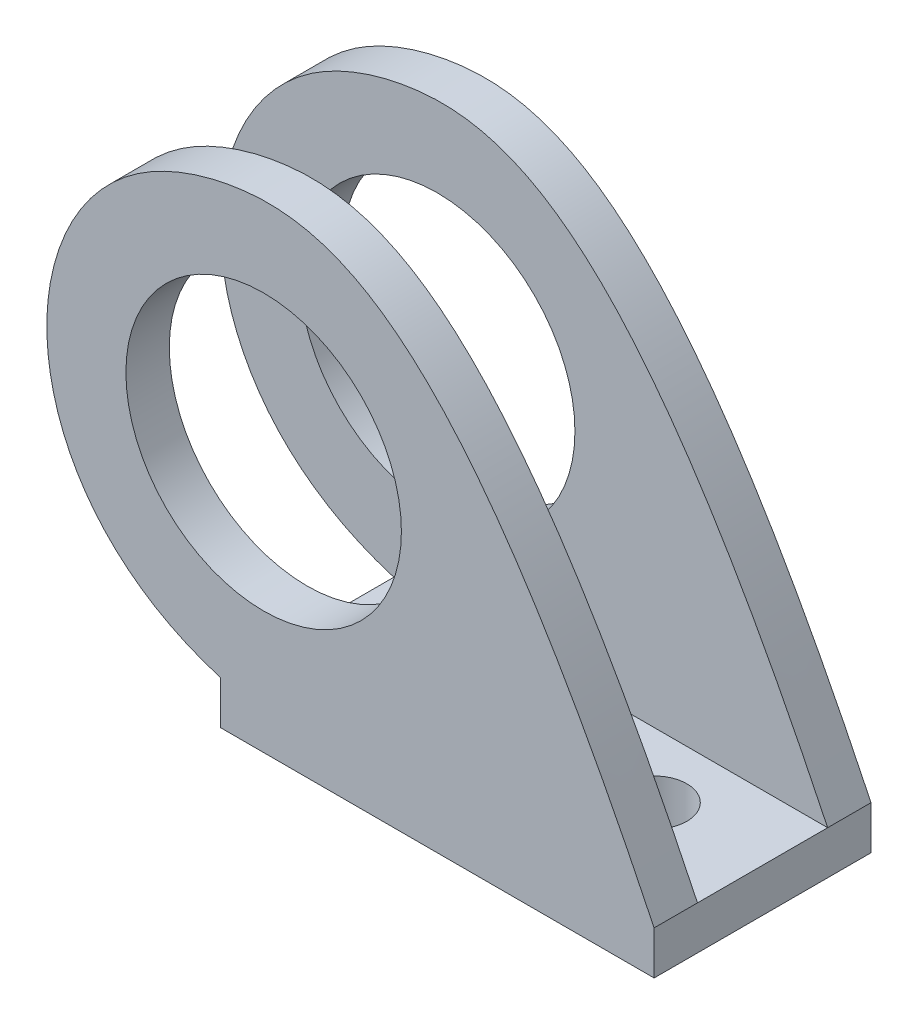
ISO-10303-21;
HEADER;
FILE_DESCRIPTION(('STEP AP214'),'2;1');
FILE_NAME('part.step','',(''),(''),'','','');
FILE_SCHEMA(('AUTOMOTIVE_DESIGN { 1 0 10303 214 1 1 1 1 }'));
ENDSEC;
DATA;
#1=APPLICATION_CONTEXT('core data for automotive mechanical design processes');
#2=APPLICATION_PROTOCOL_DEFINITION('international standard','automotive_design',2000,#1);
#3=PRODUCT_CONTEXT('',#1,'mechanical');
#4=PRODUCT('Part','Part','',(#3));
#5=PRODUCT_RELATED_PRODUCT_CATEGORY('part','',(#4));
#6=PRODUCT_DEFINITION_FORMATION('','',#4);
#7=PRODUCT_DEFINITION_CONTEXT('part definition',#1,'design');
#8=PRODUCT_DEFINITION('design','',#6,#7);
#9=PRODUCT_DEFINITION_SHAPE('','',#8);
#10=(LENGTH_UNIT() NAMED_UNIT(*) SI_UNIT(.MILLI.,.METRE.));
#11=(NAMED_UNIT(*) PLANE_ANGLE_UNIT() SI_UNIT($,.RADIAN.));
#12=(NAMED_UNIT(*) SI_UNIT($,.STERADIAN.) SOLID_ANGLE_UNIT());
#13=UNCERTAINTY_MEASURE_WITH_UNIT(LENGTH_MEASURE(1.E-05),#10,'distance_accuracy_value','');
#14=(GEOMETRIC_REPRESENTATION_CONTEXT(3) GLOBAL_UNCERTAINTY_ASSIGNED_CONTEXT((#13)) GLOBAL_UNIT_ASSIGNED_CONTEXT((#10,
#11,#12)) REPRESENTATION_CONTEXT('',''));
#15=CARTESIAN_POINT('',(0.,0.,0.));
#16=DIRECTION('',(0.,0.,1.));
#17=DIRECTION('',(1.,0.,0.));
#18=AXIS2_PLACEMENT_3D('',#15,#16,#17);
#19=CARTESIAN_POINT('',(0.,2.,0.));
#20=DIRECTION('',(0.,-1.,0.));
#21=DIRECTION('',(0.,0.,-1.));
#22=AXIS2_PLACEMENT_3D('',#19,#20,#21);
#23=PLANE('',#22);
#24=CARTESIAN_POINT('',(5.,2.,-0.0100000000000002));
#25=DIRECTION('',(0.,1.,0.));
#26=DIRECTION('',(0.,0.,1.));
#27=AXIS2_PLACEMENT_3D('',#24,#25,#26);
#28=CIRCLE('',#27,1.5);
#29=CARTESIAN_POINT('',(5.,2.,1.49));
#30=VERTEX_POINT('',#29);
#31=EDGE_CURVE('E167',#30,#30,#28,.T.);
#32=ORIENTED_EDGE('',*,*,#31,.F.);
#33=EDGE_LOOP('',(#32));
#34=FACE_BOUND('',#33,.T.);
#35=CARTESIAN_POINT('',(-5.,2.,-0.00999999999999959));
#36=DIRECTION('',(0.,1.,0.));
#37=DIRECTION('',(0.,0.,1.));
#38=AXIS2_PLACEMENT_3D('',#35,#36,#37);
#39=CIRCLE('',#38,1.5);
#40=CARTESIAN_POINT('',(-5.,2.,1.49));
#41=VERTEX_POINT('',#40);
#42=EDGE_CURVE('E121',#41,#41,#39,.T.);
#43=ORIENTED_EDGE('',*,*,#42,.F.);
#44=EDGE_LOOP('',(#43));
#45=FACE_BOUND('',#44,.T.);
#46=DIRECTION('',(0.,0.,-1.));
#47=VECTOR('',#46,1.);
#48=CARTESIAN_POINT('',(10.,2.,5.));
#49=LINE('',#48,#47);
#50=CARTESIAN_POINT('',(10.,2.,3.));
#51=VERTEX_POINT('',#50);
#52=CARTESIAN_POINT('',(10.,2.,-3.));
#53=VERTEX_POINT('',#52);
#54=EDGE_CURVE('E99',#51,#53,#49,.T.);
#55=ORIENTED_EDGE('',*,*,#54,.T.);
#56=DIRECTION('',(-1.,0.,0.));
#57=VECTOR('',#56,1.);
#58=CARTESIAN_POINT('',(0.,2.,-3.));
#59=LINE('',#58,#57);
#60=CARTESIAN_POINT('',(-10.,2.,-3.));
#61=VERTEX_POINT('',#60);
#62=EDGE_CURVE('E97',#53,#61,#59,.T.);
#63=ORIENTED_EDGE('',*,*,#62,.T.);
#64=DIRECTION('',(0.,0.,1.));
#65=VECTOR('',#64,1.);
#66=CARTESIAN_POINT('',(-10.,2.,5.));
#67=LINE('',#66,#65);
#68=CARTESIAN_POINT('',(-10.,2.,3.));
#69=VERTEX_POINT('',#68);
#70=EDGE_CURVE('E85',#61,#69,#67,.T.);
#71=ORIENTED_EDGE('',*,*,#70,.T.);
#72=DIRECTION('',(-1.,0.,0.));
#73=VECTOR('',#72,1.);
#74=CARTESIAN_POINT('',(0.,2.,3.));
#75=LINE('',#74,#73);
#76=EDGE_CURVE('E54',#51,#69,#75,.T.);
#77=ORIENTED_EDGE('',*,*,#76,.F.);
#78=EDGE_LOOP('',(#55,#63,#71,#77));
#79=FACE_BOUND('',#78,.T.);
#80=ADVANCED_FACE('F32',(#34,#45,#79),#23,.F.);
#81=CARTESIAN_POINT('',(0.,0.,0.));
#82=DIRECTION('',(0.,-1.,0.));
#83=DIRECTION('',(0.,0.,-1.));
#84=AXIS2_PLACEMENT_3D('',#81,#82,#83);
#85=PLANE('',#84);
#86=DIRECTION('',(1.,0.,0.));
#87=VECTOR('',#86,1.);
#88=CARTESIAN_POINT('',(-10.,0.,5.));
#89=LINE('',#88,#87);
#90=CARTESIAN_POINT('',(-10.,0.,5.));
#91=VERTEX_POINT('',#90);
#92=CARTESIAN_POINT('',(10.,0.,5.));
#93=VERTEX_POINT('',#92);
#94=EDGE_CURVE('E125',#91,#93,#89,.T.);
#95=ORIENTED_EDGE('',*,*,#94,.F.);
#96=DIRECTION('',(0.,0.,1.));
#97=VECTOR('',#96,1.);
#98=CARTESIAN_POINT('',(-10.,0.,5.));
#99=LINE('',#98,#97);
#100=CARTESIAN_POINT('',(-10.,0.,-5.));
#101=VERTEX_POINT('',#100);
#102=EDGE_CURVE('E123',#101,#91,#99,.T.);
#103=ORIENTED_EDGE('',*,*,#102,.F.);
#104=DIRECTION('',(-1.,0.,0.));
#105=VECTOR('',#104,1.);
#106=CARTESIAN_POINT('',(-10.,0.,-5.));
#107=LINE('',#106,#105);
#108=CARTESIAN_POINT('',(10.,0.,-5.));
#109=VERTEX_POINT('',#108);
#110=EDGE_CURVE('E120',#109,#101,#107,.T.);
#111=ORIENTED_EDGE('',*,*,#110,.F.);
#112=DIRECTION('',(0.,0.,-1.));
#113=VECTOR('',#112,1.);
#114=CARTESIAN_POINT('',(10.,0.,5.));
#115=LINE('',#114,#113);
#116=EDGE_CURVE('E118',#93,#109,#115,.T.);
#117=ORIENTED_EDGE('',*,*,#116,.F.);
#118=EDGE_LOOP('',(#95,#103,#111,#117));
#119=FACE_BOUND('',#118,.T.);
#120=CARTESIAN_POINT('',(-5.,0.,-0.00999999999999959));
#121=DIRECTION('',(0.,1.,0.));
#122=DIRECTION('',(0.,0.,1.));
#123=AXIS2_PLACEMENT_3D('',#120,#121,#122);
#124=CIRCLE('',#123,1.5);
#125=CARTESIAN_POINT('',(-5.,0.,1.49));
#126=VERTEX_POINT('',#125);
#127=EDGE_CURVE('E170',#126,#126,#124,.T.);
#128=ORIENTED_EDGE('',*,*,#127,.T.);
#129=EDGE_LOOP('',(#128));
#130=FACE_BOUND('',#129,.T.);
#131=CARTESIAN_POINT('',(5.,0.,-0.0100000000000002));
#132=DIRECTION('',(0.,1.,0.));
#133=DIRECTION('',(0.,0.,1.));
#134=AXIS2_PLACEMENT_3D('',#131,#132,#133);
#135=CIRCLE('',#134,1.5);
#136=CARTESIAN_POINT('',(5.,0.,1.49));
#137=VERTEX_POINT('',#136);
#138=EDGE_CURVE('E166',#137,#137,#135,.T.);
#139=ORIENTED_EDGE('',*,*,#138,.T.);
#140=EDGE_LOOP('',(#139));
#141=FACE_BOUND('',#140,.T.);
#142=ADVANCED_FACE('F133',(#119,#130,#141),#85,.T.);
#143=CARTESIAN_POINT('',(10.,2.,5.));
#144=DIRECTION('',(-1.,0.,0.));
#145=DIRECTION('',(0.,0.,1.));
#146=AXIS2_PLACEMENT_3D('',#143,#144,#145);
#147=PLANE('',#146);
#148=ORIENTED_EDGE('',*,*,#116,.T.);
#149=DIRECTION('',(0.,-1.,0.));
#150=VECTOR('',#149,1.);
#151=CARTESIAN_POINT('',(10.,2.,-5.));
#152=LINE('',#151,#150);
#153=CARTESIAN_POINT('',(10.,2.,-5.));
#154=VERTEX_POINT('',#153);
#155=EDGE_CURVE('E11',#154,#109,#152,.T.);
#156=ORIENTED_EDGE('',*,*,#155,.F.);
#157=DIRECTION('',(0.,0.,-1.));
#158=VECTOR('',#157,1.);
#159=CARTESIAN_POINT('',(10.,2.,-3.));
#160=LINE('',#159,#158);
#161=EDGE_CURVE('E47',#53,#154,#160,.T.);
#162=ORIENTED_EDGE('',*,*,#161,.F.);
#163=ORIENTED_EDGE('',*,*,#54,.F.);
#164=CARTESIAN_POINT('',(10.,2.,5.));
#165=VERTEX_POINT('',#164);
#166=EDGE_CURVE('E94',#165,#51,#49,.T.);
#167=ORIENTED_EDGE('',*,*,#166,.F.);
#168=DIRECTION('',(0.,-1.,0.));
#169=VECTOR('',#168,1.);
#170=CARTESIAN_POINT('',(10.,2.,5.));
#171=LINE('',#170,#169);
#172=EDGE_CURVE('E111',#165,#93,#171,.T.);
#173=ORIENTED_EDGE('',*,*,#172,.T.);
#174=EDGE_LOOP('',(#148,#156,#162,#163,#167,#173));
#175=FACE_BOUND('',#174,.T.);
#176=ADVANCED_FACE('F34',(#175),#147,.F.);
#177=CARTESIAN_POINT('',(-10.,2.,-5.));
#178=DIRECTION('',(0.,0.,1.));
#179=DIRECTION('',(1.,0.,0.));
#180=AXIS2_PLACEMENT_3D('',#177,#178,#179);
#181=PLANE('',#180);
#182=ORIENTED_EDGE('',*,*,#110,.T.);
#183=DIRECTION('',(0.,-1.,0.));
#184=VECTOR('',#183,1.);
#185=CARTESIAN_POINT('',(-10.,2.,-5.));
#186=LINE('',#185,#184);
#187=CARTESIAN_POINT('',(-10.,2.,-5.));
#188=VERTEX_POINT('',#187);
#189=EDGE_CURVE('E40',#188,#101,#186,.T.);
#190=ORIENTED_EDGE('',*,*,#189,.F.);
#191=CARTESIAN_POINT('',(10.,1.99999999999994,-5.));
#192=CARTESIAN_POINT('',(1.47048046340723,19.8137886636705,-5.));
#193=CARTESIAN_POINT('',(-5.49688785335975,23.5991499023757,-5.));
#194=CARTESIAN_POINT('',(-20.0011230045606,18.401993577392,-5.));
#195=CARTESIAN_POINT('',(-19.9343125674714,5.00893865284892,-5.));
#196=CARTESIAN_POINT('',(-10.,2.,-5.));
#197=B_SPLINE_CURVE_WITH_KNOTS('',3,(#191,#192,#193,#194,#195,#196),.UNSPECIFIED.,.F.,.F.,(4,1,
1,4),(0.,0.373203038213867,0.473203038213867,1.),.UNSPECIFIED.);
#198=EDGE_CURVE('E107',#154,#188,#197,.T.);
#199=ORIENTED_EDGE('',*,*,#198,.F.);
#200=ORIENTED_EDGE('',*,*,#155,.T.);
#201=EDGE_LOOP('',(#182,#190,#199,#200));
#202=FACE_BOUND('',#201,.T.);
#203=CARTESIAN_POINT('',(-8.,12.,-5.));
#204=DIRECTION('',(0.,0.,1.));
#205=DIRECTION('',(1.,0.,0.));
#206=AXIS2_PLACEMENT_3D('',#203,#204,#205);
#207=CIRCLE('',#206,6.35);
#208=CARTESIAN_POINT('',(-1.65,12.,-5.));
#209=VERTEX_POINT('',#208);
#210=EDGE_CURVE('E210',#209,#209,#207,.T.);
#211=ORIENTED_EDGE('',*,*,#210,.T.);
#212=EDGE_LOOP('',(#211));
#213=FACE_BOUND('',#212,.T.);
#214=ADVANCED_FACE('F202',(#202,#213),#181,.F.);
#215=CARTESIAN_POINT('',(-10.,2.,5.));
#216=DIRECTION('',(1.,0.,0.));
#217=DIRECTION('',(0.,0.,-1.));
#218=AXIS2_PLACEMENT_3D('',#215,#216,#217);
#219=PLANE('',#218);
#220=ORIENTED_EDGE('',*,*,#70,.F.);
#221=EDGE_CURVE('E90',#188,#61,#67,.T.);
#222=ORIENTED_EDGE('',*,*,#221,.F.);
#223=ORIENTED_EDGE('',*,*,#189,.T.);
#224=ORIENTED_EDGE('',*,*,#102,.T.);
#225=DIRECTION('',(0.,-1.,0.));
#226=VECTOR('',#225,1.);
#227=CARTESIAN_POINT('',(-10.,2.,5.));
#228=LINE('',#227,#226);
#229=CARTESIAN_POINT('',(-10.,2.,5.));
#230=VERTEX_POINT('',#229);
#231=EDGE_CURVE('E113',#230,#91,#228,.T.);
#232=ORIENTED_EDGE('',*,*,#231,.F.);
#233=DIRECTION('',(0.,0.,1.));
#234=VECTOR('',#233,1.);
#235=CARTESIAN_POINT('',(-10.,2.,3.));
#236=LINE('',#235,#234);
#237=EDGE_CURVE('E93',#69,#230,#236,.T.);
#238=ORIENTED_EDGE('',*,*,#237,.F.);
#239=EDGE_LOOP('',(#220,#222,#223,#224,#232,#238));
#240=FACE_BOUND('',#239,.T.);
#241=ADVANCED_FACE('F87',(#240),#219,.F.);
#242=CARTESIAN_POINT('',(-10.,2.,5.));
#243=DIRECTION('',(0.,0.,-1.));
#244=DIRECTION('',(-1.,0.,0.));
#245=AXIS2_PLACEMENT_3D('',#242,#243,#244);
#246=PLANE('',#245);
#247=ORIENTED_EDGE('',*,*,#94,.T.);
#248=ORIENTED_EDGE('',*,*,#172,.F.);
#249=CARTESIAN_POINT('',(10.,1.99999999999994,5.));
#250=CARTESIAN_POINT('',(1.47048046340723,19.8137886636705,5.));
#251=CARTESIAN_POINT('',(-5.49688785335975,23.5991499023757,5.));
#252=CARTESIAN_POINT('',(-20.0011230045606,18.401993577392,5.));
#253=CARTESIAN_POINT('',(-19.9343125674714,5.00893865284892,5.));
#254=CARTESIAN_POINT('',(-10.,2.,5.));
#255=B_SPLINE_CURVE_WITH_KNOTS('',3,(#249,#250,#251,#252,#253,#254),.UNSPECIFIED.,.F.,.F.,(4,1,
1,4),(0.,0.373203038213867,0.473203038213867,1.),.UNSPECIFIED.);
#256=EDGE_CURVE('E146',#165,#230,#255,.T.);
#257=ORIENTED_EDGE('',*,*,#256,.T.);
#258=ORIENTED_EDGE('',*,*,#231,.T.);
#259=EDGE_LOOP('',(#247,#248,#257,#258));
#260=FACE_BOUND('',#259,.T.);
#261=CARTESIAN_POINT('',(-8.,12.,5.));
#262=DIRECTION('',(0.,0.,1.));
#263=DIRECTION('',(1.,0.,0.));
#264=AXIS2_PLACEMENT_3D('',#261,#262,#263);
#265=CIRCLE('',#264,6.35);
#266=CARTESIAN_POINT('',(-1.65,12.,5.));
#267=VERTEX_POINT('',#266);
#268=EDGE_CURVE('E102',#267,#267,#265,.T.);
#269=ORIENTED_EDGE('',*,*,#268,.F.);
#270=EDGE_LOOP('',(#269));
#271=FACE_BOUND('',#270,.T.);
#272=ADVANCED_FACE('F137',(#260,#271),#246,.F.);
#273=CARTESIAN_POINT('',(-5.,2.,-0.00999999999999959));
#274=DIRECTION('',(0.,-1.,0.));
#275=DIRECTION('',(0.,0.,-1.));
#276=AXIS2_PLACEMENT_3D('',#273,#274,#275);
#277=CYLINDRICAL_SURFACE('',#276,1.5);
#278=ORIENTED_EDGE('',*,*,#42,.T.);
#279=EDGE_LOOP('',(#278));
#280=FACE_BOUND('',#279,.T.);
#281=ORIENTED_EDGE('',*,*,#127,.F.);
#282=EDGE_LOOP('',(#281));
#283=FACE_BOUND('',#282,.T.);
#284=ADVANCED_FACE('F178',(#280,#283),#277,.F.);
#285=CARTESIAN_POINT('',(5.,2.,-0.0100000000000002));
#286=DIRECTION('',(0.,-1.,0.));
#287=DIRECTION('',(0.,0.,-1.));
#288=AXIS2_PLACEMENT_3D('',#285,#286,#287);
#289=CYLINDRICAL_SURFACE('',#288,1.5);
#290=ORIENTED_EDGE('',*,*,#31,.T.);
#291=EDGE_LOOP('',(#290));
#292=FACE_BOUND('',#291,.T.);
#293=ORIENTED_EDGE('',*,*,#138,.F.);
#294=EDGE_LOOP('',(#293));
#295=FACE_BOUND('',#294,.T.);
#296=ADVANCED_FACE('F180',(#292,#295),#289,.F.);
#297=CARTESIAN_POINT('',(-14.5056067367545,19.6833946099916,3.));
#298=DIRECTION('',(0.,0.,1.));
#299=DIRECTION('',(1.,0.,0.));
#300=AXIS2_PLACEMENT_3D('',#297,#298,#299);
#301=PLANE('',#300);
#302=CARTESIAN_POINT('',(-8.,12.,3.));
#303=DIRECTION('',(0.,0.,1.));
#304=DIRECTION('',(1.,0.,0.));
#305=AXIS2_PLACEMENT_3D('',#302,#303,#304);
#306=CIRCLE('',#305,6.35);
#307=CARTESIAN_POINT('',(-1.65,12.,3.));
#308=VERTEX_POINT('',#307);
#309=EDGE_CURVE('E149',#308,#308,#306,.T.);
#310=ORIENTED_EDGE('',*,*,#309,.T.);
#311=EDGE_LOOP('',(#310));
#312=FACE_BOUND('',#311,.T.);
#313=CARTESIAN_POINT('',(10.,1.99999999999994,3.));
#314=CARTESIAN_POINT('',(1.47048046340723,19.8137886636705,3.));
#315=CARTESIAN_POINT('',(-5.49688785335975,23.5991499023757,3.));
#316=CARTESIAN_POINT('',(-20.0011230045606,18.401993577392,3.));
#317=CARTESIAN_POINT('',(-19.9343125674714,5.00893865284892,3.));
#318=CARTESIAN_POINT('',(-10.,2.,3.));
#319=B_SPLINE_CURVE_WITH_KNOTS('',3,(#313,#314,#315,#316,#317,#318),.UNSPECIFIED.,.F.,.F.,(4,1,
1,4),(0.,0.373203038213867,0.473203038213867,1.),.UNSPECIFIED.);
#320=EDGE_CURVE('E148',#51,#69,#319,.T.);
#321=ORIENTED_EDGE('',*,*,#320,.F.);
#322=ORIENTED_EDGE('',*,*,#76,.T.);
#323=EDGE_LOOP('',(#321,#322));
#324=FACE_BOUND('',#323,.T.);
#325=ADVANCED_FACE('F187',(#312,#324),#301,.F.);
#326=DIRECTION('',(0.,0.,1.));
#327=VECTOR('',#326,1.);
#328=SURFACE_OF_LINEAR_EXTRUSION('',#319,#327);
#329=ORIENTED_EDGE('',*,*,#256,.F.);
#330=ORIENTED_EDGE('',*,*,#166,.T.);
#331=ORIENTED_EDGE('',*,*,#320,.T.);
#332=ORIENTED_EDGE('',*,*,#237,.T.);
#333=EDGE_LOOP('',(#329,#330,#331,#332));
#334=FACE_BOUND('',#333,.T.);
#335=ADVANCED_FACE('F147',(#334),#328,.T.);
#336=CARTESIAN_POINT('',(-8.,12.,3.));
#337=DIRECTION('',(0.,0.,1.));
#338=DIRECTION('',(1.,0.,0.));
#339=AXIS2_PLACEMENT_3D('',#336,#337,#338);
#340=CYLINDRICAL_SURFACE('',#339,6.35);
#341=ORIENTED_EDGE('',*,*,#309,.F.);
#342=EDGE_LOOP('',(#341));
#343=FACE_BOUND('',#342,.T.);
#344=ORIENTED_EDGE('',*,*,#268,.T.);
#345=EDGE_LOOP('',(#344));
#346=FACE_BOUND('',#345,.T.);
#347=ADVANCED_FACE('F232',(#343,#346),#340,.F.);
#348=CARTESIAN_POINT('',(-14.5056067367545,19.6833946099916,-3.));
#349=DIRECTION('',(0.,0.,1.));
#350=DIRECTION('',(1.,0.,0.));
#351=AXIS2_PLACEMENT_3D('',#348,#349,#350);
#352=PLANE('',#351);
#353=CARTESIAN_POINT('',(-8.,12.,-3.));
#354=DIRECTION('',(0.,0.,1.));
#355=DIRECTION('',(1.,0.,0.));
#356=AXIS2_PLACEMENT_3D('',#353,#354,#355);
#357=CIRCLE('',#356,6.35);
#358=CARTESIAN_POINT('',(-1.65,12.,-3.));
#359=VERTEX_POINT('',#358);
#360=EDGE_CURVE('E212',#359,#359,#357,.T.);
#361=ORIENTED_EDGE('',*,*,#360,.F.);
#362=EDGE_LOOP('',(#361));
#363=FACE_BOUND('',#362,.T.);
#364=ORIENTED_EDGE('',*,*,#62,.F.);
#365=CARTESIAN_POINT('',(10.,1.99999999999994,-3.));
#366=CARTESIAN_POINT('',(1.47048046340723,19.8137886636705,-3.));
#367=CARTESIAN_POINT('',(-5.49688785335975,23.5991499023757,-3.));
#368=CARTESIAN_POINT('',(-20.0011230045606,18.401993577392,-3.));
#369=CARTESIAN_POINT('',(-19.9343125674714,5.00893865284892,-3.));
#370=CARTESIAN_POINT('',(-10.,2.,-3.));
#371=B_SPLINE_CURVE_WITH_KNOTS('',3,(#365,#366,#367,#368,#369,#370),.UNSPECIFIED.,.F.,.F.,(4,1,
1,4),(0.,0.373203038213867,0.473203038213867,1.),.UNSPECIFIED.);
#372=EDGE_CURVE('E104',#53,#61,#371,.T.);
#373=ORIENTED_EDGE('',*,*,#372,.T.);
#374=EDGE_LOOP('',(#364,#373));
#375=FACE_BOUND('',#374,.T.);
#376=ADVANCED_FACE('F105',(#363,#375),#352,.T.);
#377=DIRECTION('',(0.,0.,-1.));
#378=VECTOR('',#377,1.);
#379=SURFACE_OF_LINEAR_EXTRUSION('',#371,#378);
#380=ORIENTED_EDGE('',*,*,#198,.T.);
#381=ORIENTED_EDGE('',*,*,#221,.T.);
#382=ORIENTED_EDGE('',*,*,#372,.F.);
#383=ORIENTED_EDGE('',*,*,#161,.T.);
#384=EDGE_LOOP('',(#380,#381,#382,#383));
#385=FACE_BOUND('',#384,.T.);
#386=ADVANCED_FACE('F109',(#385),#379,.F.);
#387=CARTESIAN_POINT('',(-8.,12.,-3.));
#388=DIRECTION('',(0.,0.,-1.));
#389=DIRECTION('',(-1.,0.,0.));
#390=AXIS2_PLACEMENT_3D('',#387,#388,#389);
#391=CYLINDRICAL_SURFACE('',#390,6.35);
#392=ORIENTED_EDGE('',*,*,#360,.T.);
#393=EDGE_LOOP('',(#392));
#394=FACE_BOUND('',#393,.T.);
#395=ORIENTED_EDGE('',*,*,#210,.F.);
#396=EDGE_LOOP('',(#395));
#397=FACE_BOUND('',#396,.T.);
#398=ADVANCED_FACE('F230',(#394,#397),#391,.F.);
#399=CLOSED_SHELL('',(#80,#142,#176,#214,#241,#272,#284,#296,#325,#335,#347,#376,#386,#398));
#400=MANIFOLD_SOLID_BREP('B2',#399);
#401=ADVANCED_BREP_SHAPE_REPRESENTATION('',(#18,#400),#14);
#402=SHAPE_DEFINITION_REPRESENTATION(#9,#401);
ENDSEC;
END-ISO-10303-21;
